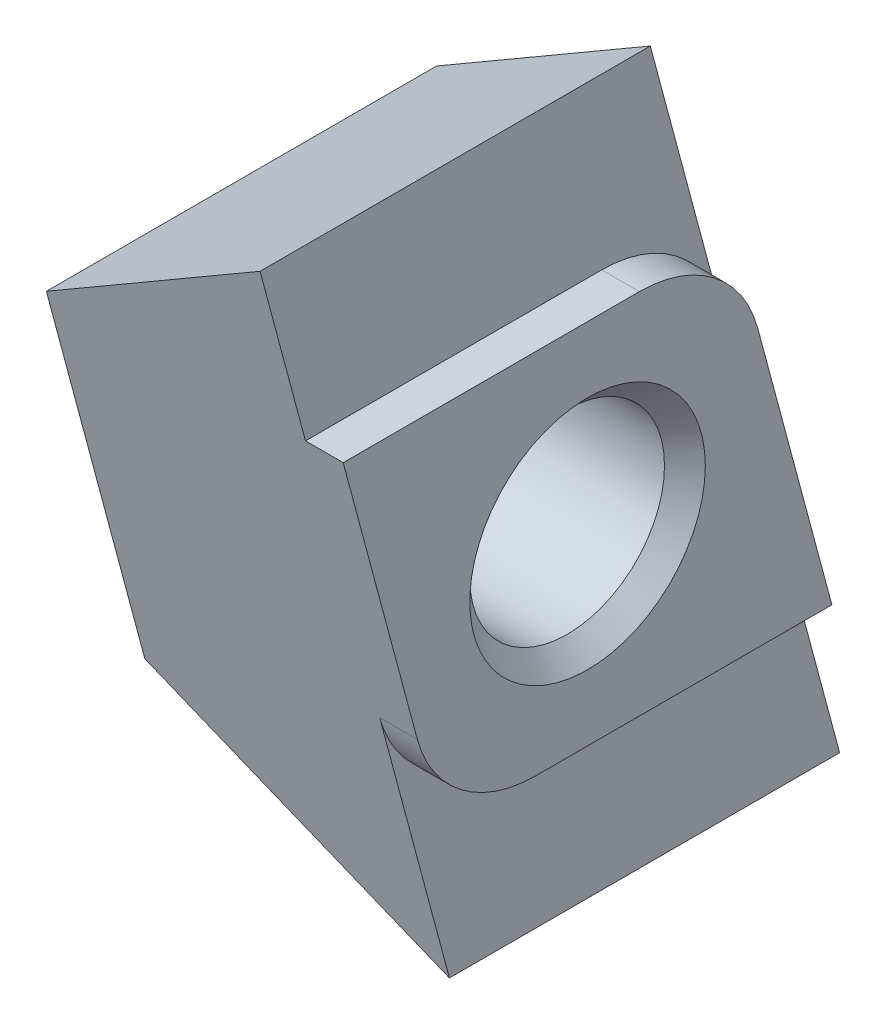
ISO-10303-21;
HEADER;
FILE_DESCRIPTION(('STEP AP214'),'2;1');
FILE_NAME('part.step','',(''),(''),'','','');
FILE_SCHEMA(('AUTOMOTIVE_DESIGN { 1 0 10303 214 1 1 1 1 }'));
ENDSEC;
DATA;
#1=APPLICATION_CONTEXT('core data for automotive mechanical design processes');
#2=APPLICATION_PROTOCOL_DEFINITION('international standard','automotive_design',2000,#1);
#3=PRODUCT_CONTEXT('',#1,'mechanical');
#4=PRODUCT('Part','Part','',(#3));
#5=PRODUCT_RELATED_PRODUCT_CATEGORY('part','',(#4));
#6=PRODUCT_DEFINITION_FORMATION('','',#4);
#7=PRODUCT_DEFINITION_CONTEXT('part definition',#1,'design');
#8=PRODUCT_DEFINITION('design','',#6,#7);
#9=PRODUCT_DEFINITION_SHAPE('','',#8);
#10=(LENGTH_UNIT() NAMED_UNIT(*) SI_UNIT(.MILLI.,.METRE.));
#11=(NAMED_UNIT(*) PLANE_ANGLE_UNIT() SI_UNIT($,.RADIAN.));
#12=(NAMED_UNIT(*) SI_UNIT($,.STERADIAN.) SOLID_ANGLE_UNIT());
#13=UNCERTAINTY_MEASURE_WITH_UNIT(LENGTH_MEASURE(1.E-05),#10,'distance_accuracy_value','');
#14=(GEOMETRIC_REPRESENTATION_CONTEXT(3) GLOBAL_UNCERTAINTY_ASSIGNED_CONTEXT((#13)) GLOBAL_UNIT_ASSIGNED_CONTEXT((#10,
#11,#12)) REPRESENTATION_CONTEXT('',''));
#15=CARTESIAN_POINT('',(0.,0.,0.));
#16=DIRECTION('',(0.,0.,1.));
#17=DIRECTION('',(1.,0.,0.));
#18=AXIS2_PLACEMENT_3D('',#15,#16,#17);
#19=CARTESIAN_POINT('',(-0.800000000000001,1.29999999999999,-1.10105270241365));
#20=DIRECTION('',(1.,0.,0.));
#21=DIRECTION('',(0.,0.,-1.));
#22=AXIS2_PLACEMENT_3D('',#19,#20,#21);
#23=CYLINDRICAL_SURFACE('',#22,2.60000000000001);
#24=CARTESIAN_POINT('',(0.,1.29999999999999,-1.10105270241365));
#25=DIRECTION('',(1.,0.,0.));
#26=DIRECTION('',(0.,0.,-1.));
#27=AXIS2_PLACEMENT_3D('',#24,#25,#26);
#28=CIRCLE('',#27,2.60000000000001);
#29=CARTESIAN_POINT('',(0.,1.97292951726655,-3.61245985076524));
#30=VERTEX_POINT('',#29);
#31=CARTESIAN_POINT('',(0.,3.9,-1.10105270241365));
#32=VERTEX_POINT('',#31);
#33=EDGE_CURVE('E150',#30,#32,#28,.T.);
#34=ORIENTED_EDGE('',*,*,#33,.F.);
#35=DIRECTION('',(1.,0.,0.));
#36=VECTOR('',#35,1.);
#37=CARTESIAN_POINT('',(-0.800000000000001,1.97292951726655,-3.61245985076524));
#38=LINE('',#37,#36);
#39=CARTESIAN_POINT('',(-0.800000000000001,1.97292951726655,-3.61245985076523));
#40=VERTEX_POINT('',#39);
#41=EDGE_CURVE('E168',#40,#30,#38,.T.);
#42=ORIENTED_EDGE('',*,*,#41,.F.);
#43=CARTESIAN_POINT('',(-0.800000000000001,1.29999999999999,-1.10105270241365));
#44=DIRECTION('',(1.,0.,0.));
#45=DIRECTION('',(0.,0.,-1.));
#46=AXIS2_PLACEMENT_3D('',#43,#44,#45);
#47=CIRCLE('',#46,2.60000000000001);
#48=CARTESIAN_POINT('',(-0.800000000000001,3.9,-1.10105270241365));
#49=VERTEX_POINT('',#48);
#50=EDGE_CURVE('E136',#40,#49,#47,.T.);
#51=ORIENTED_EDGE('',*,*,#50,.T.);
#52=DIRECTION('',(1.,0.,0.));
#53=VECTOR('',#52,1.);
#54=CARTESIAN_POINT('',(-0.800000000000001,3.9,-1.10105270241365));
#55=LINE('',#54,#53);
#56=EDGE_CURVE('E120',#49,#32,#55,.T.);
#57=ORIENTED_EDGE('',*,*,#56,.T.);
#58=EDGE_LOOP('',(#34,#42,#51,#57));
#59=FACE_BOUND('',#58,.T.);
#60=ADVANCED_FACE('F33',(#59),#23,.T.);
#61=CARTESIAN_POINT('',(-0.800000000000001,-3.9,-5.18610657212171));
#62=DIRECTION('',(0.,0.25881904510252,-0.965925826289068));
#63=DIRECTION('',(0.,0.965925826289068,0.25881904510252));
#64=AXIS2_PLACEMENT_3D('',#61,#62,#63);
#65=PLANE('',#64);
#66=DIRECTION('',(0.,0.965925826289068,0.25881904510252));
#67=VECTOR('',#66,1.);
#68=CARTESIAN_POINT('',(0.,-3.9,-5.18610657212171));
#69=LINE('',#68,#67);
#70=CARTESIAN_POINT('',(0.,-3.9,-5.18610657212171));
#71=VERTEX_POINT('',#70);
#72=EDGE_CURVE('E274',#71,#30,#69,.T.);
#73=ORIENTED_EDGE('',*,*,#72,.F.);
#74=DIRECTION('',(1.,0.,0.));
#75=VECTOR('',#74,1.);
#76=CARTESIAN_POINT('',(-0.800000000000001,-3.9,-5.18610657212171));
#77=LINE('',#76,#75);
#78=CARTESIAN_POINT('',(-0.800000000000001,-3.9,-5.18610657212171));
#79=VERTEX_POINT('',#78);
#80=EDGE_CURVE('E130',#79,#71,#77,.T.);
#81=ORIENTED_EDGE('',*,*,#80,.F.);
#82=CARTESIAN_POINT('',(-0.800000000000001,7.5,-2.13148577840691));
#83=CARTESIAN_POINT('',(-0.800000000000001,2.5,-3.47123174056252));
#84=CARTESIAN_POINT('',(-0.800000000000001,-2.5,-4.81097770271814));
#85=CARTESIAN_POINT('',(-0.800000000000001,-7.5,-6.15072366487375));
#86=B_SPLINE_CURVE_WITH_KNOTS('',3,(#82,#83,#84,#85),.UNSPECIFIED.,.F.,.F.,(4,4),(0.,1.),.UNSPECIFIED.);
#87=CARTESIAN_POINT('',(-0.800000000000001,-7.5,-6.15072366487375));
#88=VERTEX_POINT('',#87);
#89=EDGE_CURVE('E117',#79,#88,#86,.T.);
#90=ORIENTED_EDGE('',*,*,#89,.T.);
#91=DIRECTION('',(-0.827835666345006,0.541856072516727,0.145189897044757));
#92=VECTOR('',#91,1.);
#93=CARTESIAN_POINT('',(-2.53078460239917,-6.36712280570237,-5.84717013553806));
#94=LINE('',#93,#92);
#95=CARTESIAN_POINT('',(-6.3,-3.90000000000003,-5.18610657212172));
#96=VERTEX_POINT('',#95);
#97=EDGE_CURVE('E157',#96,#88,#94,.F.);
#98=ORIENTED_EDGE('',*,*,#97,.F.);
#99=CARTESIAN_POINT('',(-6.3,7.5,-2.13148577840691));
#100=CARTESIAN_POINT('',(-6.3,2.5,-3.47123174056252));
#101=CARTESIAN_POINT('',(-6.3,-2.5,-4.81097770271814));
#102=CARTESIAN_POINT('',(-6.3,-7.5,-6.15072366487375));
#103=B_SPLINE_CURVE_WITH_KNOTS('',3,(#99,#100,#101,#102),.UNSPECIFIED.,.F.,.F.,(4,4),(0.,1.),.UNSPECIFIED.);
#104=CARTESIAN_POINT('',(-6.3,3.90000000000003,-3.09610287115894));
#105=VERTEX_POINT('',#104);
#106=EDGE_CURVE('E84',#105,#96,#103,.T.);
#107=ORIENTED_EDGE('',*,*,#106,.F.);
#108=DIRECTION('',(-0.827835666345006,-0.541856072516727,-0.145189897044757));
#109=VECTOR('',#108,1.);
#110=CARTESIAN_POINT('',(-0.8,7.5,-2.13148577840691));
#111=LINE('',#110,#109);
#112=CARTESIAN_POINT('',(-0.800000000000001,7.5,-2.13148577840691));
#113=VERTEX_POINT('',#112);
#114=EDGE_CURVE('E151',#105,#113,#111,.F.);
#115=ORIENTED_EDGE('',*,*,#114,.T.);
#116=EDGE_CURVE('E224',#113,#40,#86,.T.);
#117=ORIENTED_EDGE('',*,*,#116,.T.);
#118=ORIENTED_EDGE('',*,*,#41,.T.);
#119=EDGE_LOOP('',(#73,#81,#90,#98,#107,#115,#117,#118));
#120=FACE_BOUND('',#119,.T.);
#121=ADVANCED_FACE('F194',(#120),#65,.T.);
#122=CARTESIAN_POINT('',(-0.800000000000001,-3.9,1.10105270241365));
#123=DIRECTION('',(0.,-1.,0.));
#124=DIRECTION('',(0.,0.,-1.));
#125=AXIS2_PLACEMENT_3D('',#122,#123,#124);
#126=PLANE('',#125);
#127=DIRECTION('',(0.,0.,-1.));
#128=VECTOR('',#127,1.);
#129=CARTESIAN_POINT('',(0.,-3.9,1.10105270241365));
#130=LINE('',#129,#128);
#131=CARTESIAN_POINT('',(0.,-3.9,1.10105270241365));
#132=VERTEX_POINT('',#131);
#133=EDGE_CURVE('E126',#132,#71,#130,.T.);
#134=ORIENTED_EDGE('',*,*,#133,.F.);
#135=DIRECTION('',(1.,0.,0.));
#136=VECTOR('',#135,1.);
#137=CARTESIAN_POINT('',(-0.800000000000001,-3.9,1.10105270241365));
#138=LINE('',#137,#136);
#139=CARTESIAN_POINT('',(-0.800000000000001,-3.9,1.10105270241365));
#140=VERTEX_POINT('',#139);
#141=EDGE_CURVE('E123',#140,#132,#138,.T.);
#142=ORIENTED_EDGE('',*,*,#141,.F.);
#143=DIRECTION('',(0.,0.,-1.));
#144=VECTOR('',#143,1.);
#145=CARTESIAN_POINT('',(-0.800000000000001,-3.9,1.10105270241365));
#146=LINE('',#145,#144);
#147=EDGE_CURVE('E112',#140,#79,#146,.T.);
#148=ORIENTED_EDGE('',*,*,#147,.T.);
#149=ORIENTED_EDGE('',*,*,#80,.T.);
#150=EDGE_LOOP('',(#134,#142,#148,#149));
#151=FACE_BOUND('',#150,.T.);
#152=ADVANCED_FACE('F124',(#151),#126,.T.);
#153=CARTESIAN_POINT('',(-0.800000000000001,-1.3,1.10105270241365));
#154=DIRECTION('',(1.,0.,0.));
#155=DIRECTION('',(0.,0.,-1.));
#156=AXIS2_PLACEMENT_3D('',#153,#154,#155);
#157=CYLINDRICAL_SURFACE('',#156,2.6);
#158=CARTESIAN_POINT('',(0.,-1.3,1.10105270241365));
#159=DIRECTION('',(1.,0.,0.));
#160=DIRECTION('',(0.,0.,-1.));
#161=AXIS2_PLACEMENT_3D('',#158,#159,#160);
#162=CIRCLE('',#161,2.6);
#163=CARTESIAN_POINT('',(0.,-1.97292951726655,3.61245985076523));
#164=VERTEX_POINT('',#163);
#165=EDGE_CURVE('E288',#164,#132,#162,.T.);
#166=ORIENTED_EDGE('',*,*,#165,.F.);
#167=DIRECTION('',(1.,0.,0.));
#168=VECTOR('',#167,1.);
#169=CARTESIAN_POINT('',(-0.800000000000001,-1.97292951726655,3.61245985076523));
#170=LINE('',#169,#168);
#171=CARTESIAN_POINT('',(-0.800000000000001,-1.97292951726656,3.61245985076523));
#172=VERTEX_POINT('',#171);
#173=EDGE_CURVE('E131',#172,#164,#170,.T.);
#174=ORIENTED_EDGE('',*,*,#173,.F.);
#175=CARTESIAN_POINT('',(-0.800000000000001,-1.3,1.10105270241365));
#176=DIRECTION('',(1.,0.,0.));
#177=DIRECTION('',(0.,0.,-1.));
#178=AXIS2_PLACEMENT_3D('',#175,#176,#177);
#179=CIRCLE('',#178,2.6);
#180=EDGE_CURVE('E98',#172,#140,#179,.T.);
#181=ORIENTED_EDGE('',*,*,#180,.T.);
#182=ORIENTED_EDGE('',*,*,#141,.T.);
#183=EDGE_LOOP('',(#166,#174,#181,#182));
#184=FACE_BOUND('',#183,.T.);
#185=ADVANCED_FACE('F134',(#184),#157,.T.);
#186=CARTESIAN_POINT('',(-0.800000000000001,3.9,5.18610657212171));
#187=DIRECTION('',(0.,-0.258819045102521,0.965925826289068));
#188=DIRECTION('',(0.,-0.965925826289068,-0.258819045102521));
#189=AXIS2_PLACEMENT_3D('',#186,#187,#188);
#190=PLANE('',#189);
#191=DIRECTION('',(0.,-0.965925826289068,-0.258819045102521));
#192=VECTOR('',#191,1.);
#193=CARTESIAN_POINT('',(0.,3.9,5.18610657212171));
#194=LINE('',#193,#192);
#195=CARTESIAN_POINT('',(0.,3.9,5.18610657212171));
#196=VERTEX_POINT('',#195);
#197=EDGE_CURVE('E294',#196,#164,#194,.T.);
#198=ORIENTED_EDGE('',*,*,#197,.F.);
#199=DIRECTION('',(1.,0.,0.));
#200=VECTOR('',#199,1.);
#201=CARTESIAN_POINT('',(-0.800000000000001,3.9,5.18610657212171));
#202=LINE('',#201,#200);
#203=CARTESIAN_POINT('',(-0.800000000000001,3.9,5.18610657212171));
#204=VERTEX_POINT('',#203);
#205=EDGE_CURVE('E144',#204,#196,#202,.T.);
#206=ORIENTED_EDGE('',*,*,#205,.F.);
#207=CARTESIAN_POINT('',(-0.800000000000001,-7.5,2.13148577840691));
#208=CARTESIAN_POINT('',(-0.800000000000001,-2.5,3.47123174056252));
#209=CARTESIAN_POINT('',(-0.800000000000001,2.5,4.81097770271814));
#210=CARTESIAN_POINT('',(-0.800000000000001,7.5,6.15072366487375));
#211=B_SPLINE_CURVE_WITH_KNOTS('',3,(#207,#208,#209,#210),.UNSPECIFIED.,.F.,.F.,(4,4),(0.,1.),.UNSPECIFIED.);
#212=CARTESIAN_POINT('',(-0.800000000000001,7.5,6.15072366487375));
#213=VERTEX_POINT('',#212);
#214=EDGE_CURVE('E50',#204,#213,#211,.T.);
#215=ORIENTED_EDGE('',*,*,#214,.T.);
#216=DIRECTION('',(-0.827835666345006,-0.541856072516727,-0.145189897044757));
#217=VECTOR('',#216,1.);
#218=CARTESIAN_POINT('',(-2.53078460239917,6.36712280570237,5.84717013553807));
#219=LINE('',#218,#217);
#220=CARTESIAN_POINT('',(-6.3,3.90000000000003,5.18610657212172));
#221=VERTEX_POINT('',#220);
#222=EDGE_CURVE('E147',#221,#213,#219,.F.);
#223=ORIENTED_EDGE('',*,*,#222,.F.);
#224=CARTESIAN_POINT('',(-6.3,-7.5,2.13148577840691));
#225=CARTESIAN_POINT('',(-6.3,-2.5,3.47123174056252));
#226=CARTESIAN_POINT('',(-6.3,2.5,4.81097770271814));
#227=CARTESIAN_POINT('',(-6.3,7.5,6.15072366487375));
#228=B_SPLINE_CURVE_WITH_KNOTS('',3,(#224,#225,#226,#227),.UNSPECIFIED.,.F.,.F.,(4,4),(0.,1.),.UNSPECIFIED.);
#229=CARTESIAN_POINT('',(-6.3,-3.90000000000003,3.09610287115894));
#230=VERTEX_POINT('',#229);
#231=EDGE_CURVE('E154',#230,#221,#228,.T.);
#232=ORIENTED_EDGE('',*,*,#231,.F.);
#233=DIRECTION('',(-0.827835666345006,0.541856072516727,0.145189897044757));
#234=VECTOR('',#233,1.);
#235=CARTESIAN_POINT('',(-0.800000000000001,-7.5,2.1314857784069));
#236=LINE('',#235,#234);
#237=CARTESIAN_POINT('',(-0.800000000000001,-7.5,2.13148577840691));
#238=VERTEX_POINT('',#237);
#239=EDGE_CURVE('E160',#230,#238,#236,.F.);
#240=ORIENTED_EDGE('',*,*,#239,.T.);
#241=EDGE_CURVE('E229',#238,#172,#211,.T.);
#242=ORIENTED_EDGE('',*,*,#241,.T.);
#243=ORIENTED_EDGE('',*,*,#173,.T.);
#244=EDGE_LOOP('',(#198,#206,#215,#223,#232,#240,#242,#243));
#245=FACE_BOUND('',#244,.T.);
#246=ADVANCED_FACE('F228',(#245),#190,.T.);
#247=CARTESIAN_POINT('',(-0.800000000000001,3.9,-1.10105270241365));
#248=DIRECTION('',(0.,1.,0.));
#249=DIRECTION('',(0.,0.,1.));
#250=AXIS2_PLACEMENT_3D('',#247,#248,#249);
#251=PLANE('',#250);
#252=DIRECTION('',(0.,0.,1.));
#253=VECTOR('',#252,1.);
#254=CARTESIAN_POINT('',(0.,3.9,-1.10105270241365));
#255=LINE('',#254,#253);
#256=EDGE_CURVE('E292',#32,#196,#255,.T.);
#257=ORIENTED_EDGE('',*,*,#256,.F.);
#258=ORIENTED_EDGE('',*,*,#56,.F.);
#259=DIRECTION('',(0.,0.,1.));
#260=VECTOR('',#259,1.);
#261=CARTESIAN_POINT('',(-0.800000000000001,3.9,-1.10105270241365));
#262=LINE('',#261,#260);
#263=EDGE_CURVE('E109',#49,#204,#262,.T.);
#264=ORIENTED_EDGE('',*,*,#263,.T.);
#265=ORIENTED_EDGE('',*,*,#205,.T.);
#266=EDGE_LOOP('',(#257,#258,#264,#265));
#267=FACE_BOUND('',#266,.T.);
#268=ADVANCED_FACE('F205',(#267),#251,.T.);
#269=CARTESIAN_POINT('',(0.,1.29999999999999,-1.10105270241365));
#270=DIRECTION('',(1.,0.,0.));
#271=DIRECTION('',(0.,0.,-1.));
#272=AXIS2_PLACEMENT_3D('',#269,#270,#271);
#273=PLANE('',#272);
#274=CARTESIAN_POINT('',(0.,0.,0.));
#275=DIRECTION('',(1.,0.,0.));
#276=DIRECTION('',(0.,0.,-1.));
#277=AXIS2_PLACEMENT_3D('',#274,#275,#276);
#278=CIRCLE('',#277,2.49999999999966);
#279=CARTESIAN_POINT('',(0.,0.,-2.49999999999966));
#280=VERTEX_POINT('',#279);
#281=EDGE_CURVE('E42',#280,#280,#278,.F.);
#282=ORIENTED_EDGE('',*,*,#281,.T.);
#283=EDGE_LOOP('',(#282));
#284=FACE_BOUND('',#283,.T.);
#285=ORIENTED_EDGE('',*,*,#33,.T.);
#286=ORIENTED_EDGE('',*,*,#256,.T.);
#287=ORIENTED_EDGE('',*,*,#197,.T.);
#288=ORIENTED_EDGE('',*,*,#165,.T.);
#289=ORIENTED_EDGE('',*,*,#133,.T.);
#290=ORIENTED_EDGE('',*,*,#72,.T.);
#291=EDGE_LOOP('',(#285,#286,#287,#288,#289,#290));
#292=FACE_BOUND('',#291,.T.);
#293=ADVANCED_FACE('F173',(#284,#292),#273,.T.);
#294=CARTESIAN_POINT('',(-0.800000000000001,0.,4.14110472164033));
#295=DIRECTION('',(-1.,0.,0.));
#296=DIRECTION('',(0.,0.,1.));
#297=AXIS2_PLACEMENT_3D('',#294,#295,#296);
#298=PLANE('',#297);
#299=ORIENTED_EDGE('',*,*,#147,.F.);
#300=ORIENTED_EDGE('',*,*,#180,.F.);
#301=ORIENTED_EDGE('',*,*,#241,.F.);
#302=DIRECTION('',(0.,0.,1.));
#303=VECTOR('',#302,1.);
#304=CARTESIAN_POINT('',(-0.800000000000001,-7.5,2.13148577840691));
#305=LINE('',#304,#303);
#306=EDGE_CURVE('E221',#88,#238,#305,.T.);
#307=ORIENTED_EDGE('',*,*,#306,.F.);
#308=ORIENTED_EDGE('',*,*,#89,.F.);
#309=EDGE_LOOP('',(#299,#300,#301,#307,#308));
#310=FACE_BOUND('',#309,.T.);
#311=ADVANCED_FACE('F114',(#310),#298,.F.);
#312=CARTESIAN_POINT('',(-0.800000000000001,7.5,-2.13148577840691));
#313=DIRECTION('',(-0.547659174694385,0.836701516894206,0.));
#314=DIRECTION('',(-0.836701516894206,-0.547659174694385,0.));
#315=AXIS2_PLACEMENT_3D('',#312,#313,#314);
#316=PLANE('',#315);
#317=DIRECTION('',(0.,0.,-1.));
#318=VECTOR('',#317,1.);
#319=CARTESIAN_POINT('',(-0.800000000000001,7.5,-2.13148577840691));
#320=LINE('',#319,#318);
#321=EDGE_CURVE('E231',#213,#113,#320,.T.);
#322=ORIENTED_EDGE('',*,*,#321,.T.);
#323=ORIENTED_EDGE('',*,*,#114,.F.);
#324=DIRECTION('',(0.,0.,1.));
#325=VECTOR('',#324,1.);
#326=CARTESIAN_POINT('',(-6.3,3.90000000000003,-2.13148577840691));
#327=LINE('',#326,#325);
#328=EDGE_CURVE('E152',#221,#105,#327,.F.);
#329=ORIENTED_EDGE('',*,*,#328,.F.);
#330=ORIENTED_EDGE('',*,*,#222,.T.);
#331=EDGE_LOOP('',(#322,#323,#329,#330));
#332=FACE_BOUND('',#331,.T.);
#333=ADVANCED_FACE('F207',(#332),#316,.T.);
#334=CARTESIAN_POINT('',(-0.800000000000001,-7.5,2.13148577840691));
#335=DIRECTION('',(-0.547659174694385,-0.836701516894206,0.));
#336=DIRECTION('',(0.836701516894206,-0.547659174694385,0.));
#337=AXIS2_PLACEMENT_3D('',#334,#335,#336);
#338=PLANE('',#337);
#339=ORIENTED_EDGE('',*,*,#306,.T.);
#340=ORIENTED_EDGE('',*,*,#239,.F.);
#341=DIRECTION('',(0.,0.,-1.));
#342=VECTOR('',#341,1.);
#343=CARTESIAN_POINT('',(-6.3,-3.90000000000003,2.13148577840691));
#344=LINE('',#343,#342);
#345=EDGE_CURVE('E89',#96,#230,#344,.F.);
#346=ORIENTED_EDGE('',*,*,#345,.F.);
#347=ORIENTED_EDGE('',*,*,#97,.T.);
#348=EDGE_LOOP('',(#339,#340,#346,#347));
#349=FACE_BOUND('',#348,.T.);
#350=ADVANCED_FACE('F210',(#349),#338,.T.);
#351=CARTESIAN_POINT('',(-6.3,0.,4.14110472164033));
#352=DIRECTION('',(-1.,0.,0.));
#353=DIRECTION('',(0.,0.,1.));
#354=AXIS2_PLACEMENT_3D('',#351,#352,#353);
#355=PLANE('',#354);
#356=CARTESIAN_POINT('',(-6.3,0.,0.));
#357=DIRECTION('',(-1.,0.,0.));
#358=DIRECTION('',(0.,0.,1.));
#359=AXIS2_PLACEMENT_3D('',#356,#357,#358);
#360=CIRCLE('',#359,2.49999999999965);
#361=CARTESIAN_POINT('',(-6.3,0.,2.49999999999965));
#362=VERTEX_POINT('',#361);
#363=EDGE_CURVE('E11',#362,#362,#360,.F.);
#364=ORIENTED_EDGE('',*,*,#363,.T.);
#365=EDGE_LOOP('',(#364));
#366=FACE_BOUND('',#365,.T.);
#367=ORIENTED_EDGE('',*,*,#231,.T.);
#368=ORIENTED_EDGE('',*,*,#328,.T.);
#369=ORIENTED_EDGE('',*,*,#106,.T.);
#370=ORIENTED_EDGE('',*,*,#345,.T.);
#371=EDGE_LOOP('',(#367,#368,#369,#370));
#372=FACE_BOUND('',#371,.T.);
#373=ADVANCED_FACE('F213',(#366,#372),#355,.T.);
#374=ORIENTED_EDGE('',*,*,#50,.F.);
#375=ORIENTED_EDGE('',*,*,#116,.F.);
#376=ORIENTED_EDGE('',*,*,#321,.F.);
#377=ORIENTED_EDGE('',*,*,#214,.F.);
#378=ORIENTED_EDGE('',*,*,#263,.F.);
#379=EDGE_LOOP('',(#374,#375,#376,#377,#378));
#380=FACE_BOUND('',#379,.T.);
#381=ADVANCED_FACE('F184',(#380),#298,.F.);
#382=CARTESIAN_POINT('',(-6.3,0.,0.));
#383=DIRECTION('',(-1.,0.,0.));
#384=DIRECTION('',(0.,0.,1.));
#385=AXIS2_PLACEMENT_3D('',#382,#383,#384);
#386=CYLINDRICAL_SURFACE('',#385,2.06699999999999);
#387=CARTESIAN_POINT('',(-0.432999999999665,0.,0.));
#388=DIRECTION('',(1.,0.,0.));
#389=DIRECTION('',(0.,0.,-1.));
#390=AXIS2_PLACEMENT_3D('',#387,#388,#389);
#391=CIRCLE('',#390,2.06699999999999);
#392=CARTESIAN_POINT('',(-0.432999999999665,0.,-2.06699999999999));
#393=VERTEX_POINT('',#392);
#394=EDGE_CURVE('E167',#393,#393,#391,.T.);
#395=ORIENTED_EDGE('',*,*,#394,.T.);
#396=EDGE_LOOP('',(#395));
#397=FACE_BOUND('',#396,.T.);
#398=CARTESIAN_POINT('',(-5.86700000000034,0.,0.));
#399=DIRECTION('',(-1.,0.,0.));
#400=DIRECTION('',(0.,0.,1.));
#401=AXIS2_PLACEMENT_3D('',#398,#399,#400);
#402=CIRCLE('',#401,2.06699999999999);
#403=CARTESIAN_POINT('',(-5.86700000000034,0.,2.06699999999999));
#404=VERTEX_POINT('',#403);
#405=EDGE_CURVE('E164',#404,#404,#402,.T.);
#406=ORIENTED_EDGE('',*,*,#405,.T.);
#407=EDGE_LOOP('',(#406));
#408=FACE_BOUND('',#407,.T.);
#409=ADVANCED_FACE('F179',(#397,#408),#386,.F.);
#410=CARTESIAN_POINT('',(-0.432999999999665,0.,0.));
#411=DIRECTION('',(1.,0.,0.));
#412=DIRECTION('',(0.,0.,-1.));
#413=AXIS2_PLACEMENT_3D('',#410,#411,#412);
#414=CONICAL_SURFACE('',#413,2.06699999999999,0.785398163397451);
#415=ORIENTED_EDGE('',*,*,#281,.F.);
#416=EDGE_LOOP('',(#415));
#417=FACE_BOUND('',#416,.T.);
#418=ORIENTED_EDGE('',*,*,#394,.F.);
#419=EDGE_LOOP('',(#418));
#420=FACE_BOUND('',#419,.T.);
#421=ADVANCED_FACE('F176',(#417,#420),#414,.F.);
#422=CARTESIAN_POINT('',(-5.86700000000034,0.,0.));
#423=DIRECTION('',(-1.,0.,0.));
#424=DIRECTION('',(0.,0.,1.));
#425=AXIS2_PLACEMENT_3D('',#422,#423,#424);
#426=CONICAL_SURFACE('',#425,2.06699999999999,0.785398163397456);
#427=ORIENTED_EDGE('',*,*,#363,.F.);
#428=EDGE_LOOP('',(#427));
#429=FACE_BOUND('',#428,.T.);
#430=ORIENTED_EDGE('',*,*,#405,.F.);
#431=EDGE_LOOP('',(#430));
#432=FACE_BOUND('',#431,.T.);
#433=ADVANCED_FACE('F35',(#429,#432),#426,.F.);
#434=CLOSED_SHELL('',(#60,#121,#152,#185,#246,#268,#293,#311,#333,#350,#373,#381,#409,#421,#433));
#435=MANIFOLD_SOLID_BREP('B2',#434);
#436=ADVANCED_BREP_SHAPE_REPRESENTATION('',(#18,#435),#14);
#437=SHAPE_DEFINITION_REPRESENTATION(#9,#436);
ENDSEC;
END-ISO-10303-21;
